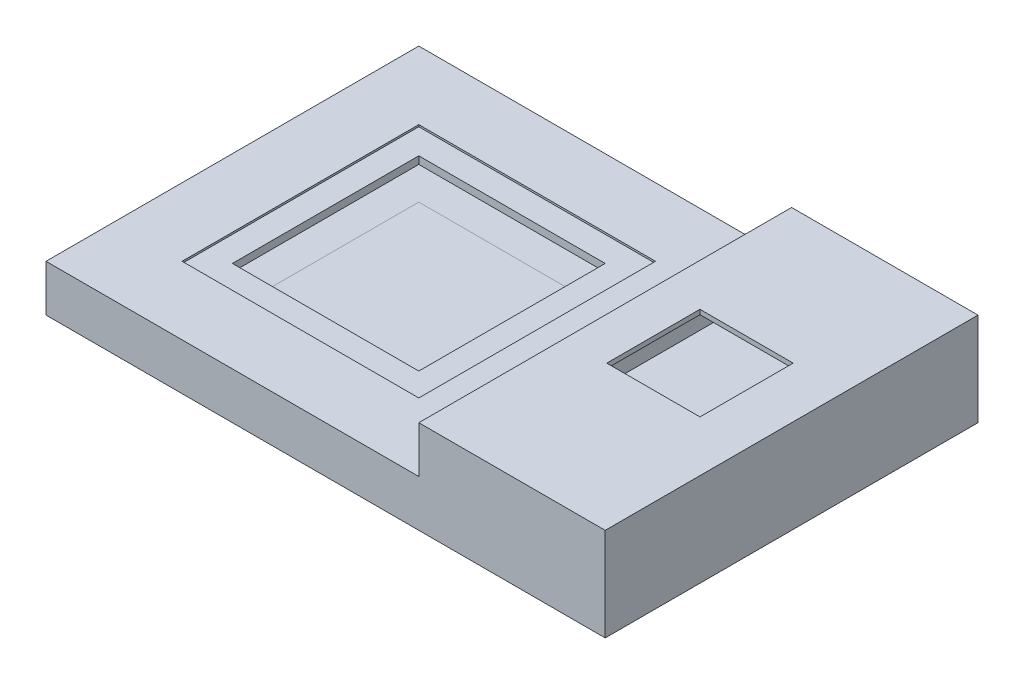
ISO-10303-21;
HEADER;
FILE_DESCRIPTION(('STEP AP214'),'2;1');
FILE_NAME('part.step','',(''),(''),'','','');
FILE_SCHEMA(('AUTOMOTIVE_DESIGN { 1 0 10303 214 1 1 1 1 }'));
ENDSEC;
DATA;
#1=APPLICATION_CONTEXT('core data for automotive mechanical design processes');
#2=APPLICATION_PROTOCOL_DEFINITION('international standard','automotive_design',2000,#1);
#3=PRODUCT_CONTEXT('',#1,'mechanical');
#4=PRODUCT('Part','Part','',(#3));
#5=PRODUCT_RELATED_PRODUCT_CATEGORY('part','',(#4));
#6=PRODUCT_DEFINITION_FORMATION('','',#4);
#7=PRODUCT_DEFINITION_CONTEXT('part definition',#1,'design');
#8=PRODUCT_DEFINITION('design','',#6,#7);
#9=PRODUCT_DEFINITION_SHAPE('','',#8);
#10=(LENGTH_UNIT() NAMED_UNIT(*) SI_UNIT(.MILLI.,.METRE.));
#11=(NAMED_UNIT(*) PLANE_ANGLE_UNIT() SI_UNIT($,.RADIAN.));
#12=(NAMED_UNIT(*) SI_UNIT($,.STERADIAN.) SOLID_ANGLE_UNIT());
#13=UNCERTAINTY_MEASURE_WITH_UNIT(LENGTH_MEASURE(1.E-05),#10,'distance_accuracy_value','');
#14=(GEOMETRIC_REPRESENTATION_CONTEXT(3) GLOBAL_UNCERTAINTY_ASSIGNED_CONTEXT((#13)) GLOBAL_UNIT_ASSIGNED_CONTEXT((#10,
#11,#12)) REPRESENTATION_CONTEXT('',''));
#15=CARTESIAN_POINT('',(0.,0.,0.));
#16=DIRECTION('',(0.,0.,1.));
#17=DIRECTION('',(1.,0.,0.));
#18=AXIS2_PLACEMENT_3D('',#15,#16,#17);
#19=CARTESIAN_POINT('',(10.,-5.,10.));
#20=DIRECTION('',(1.,0.,0.));
#21=DIRECTION('',(0.,1.,0.));
#22=AXIS2_PLACEMENT_3D('',#19,#20,#21);
#23=PLANE('',#22);
#24=DIRECTION('',(0.,0.,-1.));
#25=VECTOR('',#24,1.);
#26=CARTESIAN_POINT('',(10.,-4.5,10.));
#27=LINE('',#26,#25);
#28=CARTESIAN_POINT('',(10.,-4.5,10.));
#29=VERTEX_POINT('',#28);
#30=CARTESIAN_POINT('',(10.,-4.5,-10.));
#31=VERTEX_POINT('',#30);
#32=EDGE_CURVE('E109',#29,#31,#27,.T.);
#33=ORIENTED_EDGE('',*,*,#32,.F.);
#34=DIRECTION('',(0.,1.,0.));
#35=VECTOR('',#34,1.);
#36=CARTESIAN_POINT('',(10.,-5.,10.));
#37=LINE('',#36,#35);
#38=CARTESIAN_POINT('',(10.,-5.,10.));
#39=VERTEX_POINT('',#38);
#40=EDGE_CURVE('E12',#39,#29,#37,.T.);
#41=ORIENTED_EDGE('',*,*,#40,.F.);
#42=DIRECTION('',(0.,0.,-1.));
#43=VECTOR('',#42,1.);
#44=CARTESIAN_POINT('',(10.,-5.,10.));
#45=LINE('',#44,#43);
#46=CARTESIAN_POINT('',(10.,-5.,-10.));
#47=VERTEX_POINT('',#46);
#48=EDGE_CURVE('E103',#39,#47,#45,.T.);
#49=ORIENTED_EDGE('',*,*,#48,.T.);
#50=DIRECTION('',(0.,1.,0.));
#51=VECTOR('',#50,1.);
#52=CARTESIAN_POINT('',(10.,-5.,-10.));
#53=LINE('',#52,#51);
#54=EDGE_CURVE('E48',#47,#31,#53,.T.);
#55=ORIENTED_EDGE('',*,*,#54,.T.);
#56=EDGE_LOOP('',(#33,#41,#49,#55));
#57=FACE_BOUND('',#56,.T.);
#58=ADVANCED_FACE('F45',(#57),#23,.T.);
#59=CARTESIAN_POINT('',(-10.,-5.00000000000001,10.));
#60=DIRECTION('',(0.,0.,1.));
#61=DIRECTION('',(1.,0.,0.));
#62=AXIS2_PLACEMENT_3D('',#59,#60,#61);
#63=PLANE('',#62);
#64=DIRECTION('',(1.,0.,0.));
#65=VECTOR('',#64,1.);
#66=CARTESIAN_POINT('',(-10.,-4.50000000000001,10.));
#67=LINE('',#66,#65);
#68=CARTESIAN_POINT('',(-10.,-4.50000000000001,10.));
#69=VERTEX_POINT('',#68);
#70=EDGE_CURVE('E105',#69,#29,#67,.T.);
#71=ORIENTED_EDGE('',*,*,#70,.F.);
#72=DIRECTION('',(0.,1.,0.));
#73=VECTOR('',#72,1.);
#74=CARTESIAN_POINT('',(-10.,-5.00000000000001,10.));
#75=LINE('',#74,#73);
#76=CARTESIAN_POINT('',(-10.,-5.00000000000001,10.));
#77=VERTEX_POINT('',#76);
#78=EDGE_CURVE('E54',#77,#69,#75,.T.);
#79=ORIENTED_EDGE('',*,*,#78,.F.);
#80=DIRECTION('',(1.,0.,0.));
#81=VECTOR('',#80,1.);
#82=CARTESIAN_POINT('',(-10.,-5.00000000000001,10.));
#83=LINE('',#82,#81);
#84=EDGE_CURVE('E100',#77,#39,#83,.T.);
#85=ORIENTED_EDGE('',*,*,#84,.T.);
#86=ORIENTED_EDGE('',*,*,#40,.T.);
#87=EDGE_LOOP('',(#71,#79,#85,#86));
#88=FACE_BOUND('',#87,.T.);
#89=ADVANCED_FACE('F119',(#88),#63,.T.);
#90=CARTESIAN_POINT('',(-10.,-5.00000000000001,10.));
#91=DIRECTION('',(-1.,0.,0.));
#92=DIRECTION('',(0.,-1.,0.));
#93=AXIS2_PLACEMENT_3D('',#90,#91,#92);
#94=PLANE('',#93);
#95=DIRECTION('',(0.,0.,1.));
#96=VECTOR('',#95,1.);
#97=CARTESIAN_POINT('',(-10.,-4.50000000000001,10.));
#98=LINE('',#97,#96);
#99=CARTESIAN_POINT('',(-10.,-4.50000000000001,-10.));
#100=VERTEX_POINT('',#99);
#101=EDGE_CURVE('E95',#100,#69,#98,.T.);
#102=ORIENTED_EDGE('',*,*,#101,.F.);
#103=DIRECTION('',(0.,1.,0.));
#104=VECTOR('',#103,1.);
#105=CARTESIAN_POINT('',(-10.,-5.00000000000001,-10.));
#106=LINE('',#105,#104);
#107=CARTESIAN_POINT('',(-10.,-5.00000000000001,-10.));
#108=VERTEX_POINT('',#107);
#109=EDGE_CURVE('E90',#108,#100,#106,.T.);
#110=ORIENTED_EDGE('',*,*,#109,.F.);
#111=DIRECTION('',(0.,0.,1.));
#112=VECTOR('',#111,1.);
#113=CARTESIAN_POINT('',(-10.,-5.00000000000001,10.));
#114=LINE('',#113,#112);
#115=EDGE_CURVE('E93',#108,#77,#114,.T.);
#116=ORIENTED_EDGE('',*,*,#115,.T.);
#117=ORIENTED_EDGE('',*,*,#78,.T.);
#118=EDGE_LOOP('',(#102,#110,#116,#117));
#119=FACE_BOUND('',#118,.T.);
#120=ADVANCED_FACE('F92',(#119),#94,.T.);
#121=CARTESIAN_POINT('',(-10.,-5.00000000000001,-10.));
#122=DIRECTION('',(0.,0.,-1.));
#123=DIRECTION('',(-1.,0.,0.));
#124=AXIS2_PLACEMENT_3D('',#121,#122,#123);
#125=PLANE('',#124);
#126=DIRECTION('',(-1.,0.,0.));
#127=VECTOR('',#126,1.);
#128=CARTESIAN_POINT('',(-10.,-4.50000000000001,-10.));
#129=LINE('',#128,#127);
#130=EDGE_CURVE('E112',#31,#100,#129,.T.);
#131=ORIENTED_EDGE('',*,*,#130,.F.);
#132=ORIENTED_EDGE('',*,*,#54,.F.);
#133=DIRECTION('',(-1.,0.,0.));
#134=VECTOR('',#133,1.);
#135=CARTESIAN_POINT('',(-10.,-5.00000000000001,-10.));
#136=LINE('',#135,#134);
#137=EDGE_CURVE('E99',#47,#108,#136,.T.);
#138=ORIENTED_EDGE('',*,*,#137,.T.);
#139=ORIENTED_EDGE('',*,*,#109,.T.);
#140=EDGE_LOOP('',(#131,#132,#138,#139));
#141=FACE_BOUND('',#140,.T.);
#142=ADVANCED_FACE('F102',(#141),#125,.T.);
#143=CARTESIAN_POINT('',(0.,-5.,0.));
#144=DIRECTION('',(0.,-1.,0.));
#145=DIRECTION('',(1.,0.,0.));
#146=AXIS2_PLACEMENT_3D('',#143,#144,#145);
#147=PLANE('',#146);
#148=ORIENTED_EDGE('',*,*,#48,.F.);
#149=ORIENTED_EDGE('',*,*,#84,.F.);
#150=ORIENTED_EDGE('',*,*,#115,.F.);
#151=ORIENTED_EDGE('',*,*,#137,.F.);
#152=EDGE_LOOP('',(#148,#149,#150,#151));
#153=FACE_BOUND('',#152,.T.);
#154=ADVANCED_FACE('F98',(#153),#147,.T.);
#155=CARTESIAN_POINT('',(0.,-4.5,0.));
#156=DIRECTION('',(0.,-1.,0.));
#157=DIRECTION('',(1.,0.,0.));
#158=AXIS2_PLACEMENT_3D('',#155,#156,#157);
#159=PLANE('',#158);
#160=ORIENTED_EDGE('',*,*,#32,.T.);
#161=ORIENTED_EDGE('',*,*,#130,.T.);
#162=ORIENTED_EDGE('',*,*,#101,.T.);
#163=ORIENTED_EDGE('',*,*,#70,.T.);
#164=EDGE_LOOP('',(#160,#161,#162,#163));
#165=FACE_BOUND('',#164,.T.);
#166=ADVANCED_FACE('F118',(#165),#159,.F.);
#167=CLOSED_SHELL('',(#58,#89,#120,#142,#154,#166));
#168=MANIFOLD_SOLID_BREP('B2',#167);
#169=CARTESIAN_POINT('',(39.5,-1.,19.5));
#170=DIRECTION('',(0.,-1.,0.));
#171=DIRECTION('',(1.,0.,0.));
#172=AXIS2_PLACEMENT_3D('',#169,#170,#171);
#173=PLANE('',#172);
#174=DIRECTION('',(0.,0.,-1.));
#175=VECTOR('',#174,1.);
#176=CARTESIAN_POINT('',(10.,-1.,0.));
#177=LINE('',#176,#175);
#178=CARTESIAN_POINT('',(10.,-1.,9.99999999999999));
#179=VERTEX_POINT('',#178);
#180=CARTESIAN_POINT('',(10.,-1.,-10.));
#181=VERTEX_POINT('',#180);
#182=EDGE_CURVE('E437',#179,#181,#177,.T.);
#183=ORIENTED_EDGE('',*,*,#182,.T.);
#184=DIRECTION('',(1.,0.,0.));
#185=VECTOR('',#184,1.);
#186=CARTESIAN_POINT('',(0.,-1.00000000000001,-10.));
#187=LINE('',#186,#185);
#188=CARTESIAN_POINT('',(-9.99999999999999,-1.00000000000001,-10.));
#189=VERTEX_POINT('',#188);
#190=EDGE_CURVE('E434',#189,#181,#187,.T.);
#191=ORIENTED_EDGE('',*,*,#190,.F.);
#192=DIRECTION('',(0.,0.,-1.));
#193=VECTOR('',#192,1.);
#194=CARTESIAN_POINT('',(-9.99999999999999,-1.00000000000001,0.));
#195=LINE('',#194,#193);
#196=CARTESIAN_POINT('',(-9.99999999999999,-1.00000000000001,9.99999999999999));
#197=VERTEX_POINT('',#196);
#198=EDGE_CURVE('E431',#197,#189,#195,.T.);
#199=ORIENTED_EDGE('',*,*,#198,.F.);
#200=DIRECTION('',(1.,0.,0.));
#201=VECTOR('',#200,1.);
#202=CARTESIAN_POINT('',(0.,-1.00000000000001,9.99999999999999));
#203=LINE('',#202,#201);
#204=EDGE_CURVE('E560',#197,#179,#203,.T.);
#205=ORIENTED_EDGE('',*,*,#204,.T.);
#206=EDGE_LOOP('',(#183,#191,#199,#205));
#207=FACE_BOUND('',#206,.T.);
#208=DIRECTION('',(0.,0.,-1.));
#209=VECTOR('',#208,1.);
#210=CARTESIAN_POINT('',(-19.5,-1.00000000000001,19.5));
#211=LINE('',#210,#209);
#212=CARTESIAN_POINT('',(-19.5,-1.00000000000001,19.5));
#213=VERTEX_POINT('',#212);
#214=CARTESIAN_POINT('',(-19.5,-1.00000000000001,-19.5));
#215=VERTEX_POINT('',#214);
#216=EDGE_CURVE('E420',#213,#215,#211,.T.);
#217=ORIENTED_EDGE('',*,*,#216,.T.);
#218=DIRECTION('',(-1.,0.,0.));
#219=VECTOR('',#218,1.);
#220=CARTESIAN_POINT('',(39.5,-1.,-19.5));
#221=LINE('',#220,#219);
#222=CARTESIAN_POINT('',(20.5,-1.,-19.5));
#223=VERTEX_POINT('',#222);
#224=EDGE_CURVE('E400',#223,#215,#221,.T.);
#225=ORIENTED_EDGE('',*,*,#224,.F.);
#226=DIRECTION('',(0.,0.,-1.));
#227=VECTOR('',#226,1.);
#228=CARTESIAN_POINT('',(20.5,-1.,19.5));
#229=LINE('',#228,#227);
#230=CARTESIAN_POINT('',(20.5,-1.,19.5));
#231=VERTEX_POINT('',#230);
#232=EDGE_CURVE('E395',#231,#223,#229,.T.);
#233=ORIENTED_EDGE('',*,*,#232,.F.);
#234=DIRECTION('',(-1.,0.,0.));
#235=VECTOR('',#234,1.);
#236=CARTESIAN_POINT('',(39.5,-1.,19.5));
#237=LINE('',#236,#235);
#238=EDGE_CURVE('E409',#231,#213,#237,.T.);
#239=ORIENTED_EDGE('',*,*,#238,.T.);
#240=EDGE_LOOP('',(#217,#225,#233,#239));
#241=FACE_BOUND('',#240,.T.);
#242=ADVANCED_FACE('F169',(#207,#241),#173,.T.);
#243=CARTESIAN_POINT('',(10.,-5.,0.));
#244=DIRECTION('',(1.,0.,0.));
#245=DIRECTION('',(0.,0.,-1.));
#246=AXIS2_PLACEMENT_3D('',#243,#244,#245);
#247=PLANE('',#246);
#248=ORIENTED_EDGE('',*,*,#182,.F.);
#249=DIRECTION('',(0.,1.,0.));
#250=VECTOR('',#249,1.);
#251=CARTESIAN_POINT('',(10.,-5.,9.99999999999999));
#252=LINE('',#251,#250);
#253=CARTESIAN_POINT('',(10.,-0.2,9.99999999999999));
#254=VERTEX_POINT('',#253);
#255=EDGE_CURVE('E524',#179,#254,#252,.T.);
#256=ORIENTED_EDGE('',*,*,#255,.T.);
#257=DIRECTION('',(0.,0.,1.));
#258=VECTOR('',#257,1.);
#259=CARTESIAN_POINT('',(10.,-0.2,0.));
#260=LINE('',#259,#258);
#261=CARTESIAN_POINT('',(10.,-0.2,-10.));
#262=VERTEX_POINT('',#261);
#263=EDGE_CURVE('E477',#262,#254,#260,.T.);
#264=ORIENTED_EDGE('',*,*,#263,.F.);
#265=DIRECTION('',(0.,1.,0.));
#266=VECTOR('',#265,1.);
#267=CARTESIAN_POINT('',(10.,-5.,-10.));
#268=LINE('',#267,#266);
#269=EDGE_CURVE('E544',#181,#262,#268,.T.);
#270=ORIENTED_EDGE('',*,*,#269,.F.);
#271=EDGE_LOOP('',(#248,#256,#264,#270));
#272=FACE_BOUND('',#271,.T.);
#273=ADVANCED_FACE('F171',(#272),#247,.F.);
#274=DIRECTION('',(0.,0.,1.));
#275=VECTOR('',#274,1.);
#276=CARTESIAN_POINT('',(10.,-4.5,0.));
#277=LINE('',#276,#275);
#278=CARTESIAN_POINT('',(10.,-4.5,-10.));
#279=VERTEX_POINT('',#278);
#280=CARTESIAN_POINT('',(10.,-4.5,9.99999999999999));
#281=VERTEX_POINT('',#280);
#282=EDGE_CURVE('E429',#279,#281,#277,.T.);
#283=ORIENTED_EDGE('',*,*,#282,.F.);
#284=CARTESIAN_POINT('',(10.,-5.,-10.));
#285=VERTEX_POINT('',#284);
#286=EDGE_CURVE('E541',#285,#279,#268,.T.);
#287=ORIENTED_EDGE('',*,*,#286,.F.);
#288=DIRECTION('',(0.,0.,-1.));
#289=VECTOR('',#288,1.);
#290=CARTESIAN_POINT('',(10.,-5.,0.));
#291=LINE('',#290,#289);
#292=CARTESIAN_POINT('',(10.,-5.,9.99999999999999));
#293=VERTEX_POINT('',#292);
#294=EDGE_CURVE('E506',#293,#285,#291,.T.);
#295=ORIENTED_EDGE('',*,*,#294,.F.);
#296=EDGE_CURVE('E553',#293,#281,#252,.T.);
#297=ORIENTED_EDGE('',*,*,#296,.T.);
#298=EDGE_LOOP('',(#283,#287,#295,#297));
#299=FACE_BOUND('',#298,.T.);
#300=ADVANCED_FACE('F589',(#299),#247,.F.);
#301=CARTESIAN_POINT('',(0.,-5.,-10.));
#302=DIRECTION('',(0.,0.,1.));
#303=DIRECTION('',(1.,0.,0.));
#304=AXIS2_PLACEMENT_3D('',#301,#302,#303);
#305=PLANE('',#304);
#306=DIRECTION('',(0.,1.,0.));
#307=VECTOR('',#306,1.);
#308=CARTESIAN_POINT('',(-9.99999999999999,-5.,-10.));
#309=LINE('',#308,#307);
#310=CARTESIAN_POINT('',(-9.99999999999999,-0.2,-10.));
#311=VERTEX_POINT('',#310);
#312=EDGE_CURVE('E548',#189,#311,#309,.T.);
#313=ORIENTED_EDGE('',*,*,#312,.F.);
#314=ORIENTED_EDGE('',*,*,#190,.T.);
#315=ORIENTED_EDGE('',*,*,#269,.T.);
#316=DIRECTION('',(-1.,0.,0.));
#317=VECTOR('',#316,1.);
#318=CARTESIAN_POINT('',(0.,-0.2,-10.));
#319=LINE('',#318,#317);
#320=EDGE_CURVE('E474',#262,#311,#319,.T.);
#321=ORIENTED_EDGE('',*,*,#320,.T.);
#322=EDGE_LOOP('',(#313,#314,#315,#321));
#323=FACE_BOUND('',#322,.T.);
#324=ADVANCED_FACE('F652',(#323),#305,.T.);
#325=ORIENTED_EDGE('',*,*,#286,.T.);
#326=DIRECTION('',(-1.,0.,0.));
#327=VECTOR('',#326,1.);
#328=CARTESIAN_POINT('',(0.,-4.5,-10.));
#329=LINE('',#328,#327);
#330=CARTESIAN_POINT('',(-9.99999999999999,-4.50000000000001,-10.));
#331=VERTEX_POINT('',#330);
#332=EDGE_CURVE('E426',#279,#331,#329,.T.);
#333=ORIENTED_EDGE('',*,*,#332,.T.);
#334=CARTESIAN_POINT('',(-9.99999999999999,-5.,-10.));
#335=VERTEX_POINT('',#334);
#336=EDGE_CURVE('E545',#335,#331,#309,.T.);
#337=ORIENTED_EDGE('',*,*,#336,.F.);
#338=DIRECTION('',(1.,0.,0.));
#339=VECTOR('',#338,1.);
#340=CARTESIAN_POINT('',(0.,-5.,-10.));
#341=LINE('',#340,#339);
#342=EDGE_CURVE('E514',#335,#285,#341,.T.);
#343=ORIENTED_EDGE('',*,*,#342,.T.);
#344=EDGE_LOOP('',(#325,#333,#337,#343));
#345=FACE_BOUND('',#344,.T.);
#346=ADVANCED_FACE('F655',(#345),#305,.T.);
#347=CARTESIAN_POINT('',(-9.99999999999999,-5.,0.));
#348=DIRECTION('',(1.,0.,0.));
#349=DIRECTION('',(0.,0.,-1.));
#350=AXIS2_PLACEMENT_3D('',#347,#348,#349);
#351=PLANE('',#350);
#352=DIRECTION('',(0.,1.,0.));
#353=VECTOR('',#352,1.);
#354=CARTESIAN_POINT('',(-9.99999999999999,-5.,9.99999999999999));
#355=LINE('',#354,#353);
#356=CARTESIAN_POINT('',(-9.99999999999999,-0.2,9.99999999999999));
#357=VERTEX_POINT('',#356);
#358=EDGE_CURVE('E552',#197,#357,#355,.T.);
#359=ORIENTED_EDGE('',*,*,#358,.F.);
#360=ORIENTED_EDGE('',*,*,#198,.T.);
#361=ORIENTED_EDGE('',*,*,#312,.T.);
#362=DIRECTION('',(0.,0.,1.));
#363=VECTOR('',#362,1.);
#364=CARTESIAN_POINT('',(-9.99999999999999,-0.2,0.));
#365=LINE('',#364,#363);
#366=EDGE_CURVE('E465',#311,#357,#365,.T.);
#367=ORIENTED_EDGE('',*,*,#366,.T.);
#368=EDGE_LOOP('',(#359,#360,#361,#367));
#369=FACE_BOUND('',#368,.T.);
#370=ADVANCED_FACE('F657',(#369),#351,.T.);
#371=ORIENTED_EDGE('',*,*,#336,.T.);
#372=DIRECTION('',(0.,0.,1.));
#373=VECTOR('',#372,1.);
#374=CARTESIAN_POINT('',(-9.99999999999999,-4.50000000000001,0.));
#375=LINE('',#374,#373);
#376=CARTESIAN_POINT('',(-9.99999999999999,-4.50000000000001,9.99999999999999));
#377=VERTEX_POINT('',#376);
#378=EDGE_CURVE('E423',#331,#377,#375,.T.);
#379=ORIENTED_EDGE('',*,*,#378,.T.);
#380=CARTESIAN_POINT('',(-9.99999999999999,-5.,9.99999999999999));
#381=VERTEX_POINT('',#380);
#382=EDGE_CURVE('E549',#381,#377,#355,.T.);
#383=ORIENTED_EDGE('',*,*,#382,.F.);
#384=DIRECTION('',(0.,0.,-1.));
#385=VECTOR('',#384,1.);
#386=CARTESIAN_POINT('',(-9.99999999999999,-5.,0.));
#387=LINE('',#386,#385);
#388=EDGE_CURVE('E511',#381,#335,#387,.T.);
#389=ORIENTED_EDGE('',*,*,#388,.T.);
#390=EDGE_LOOP('',(#371,#379,#383,#389));
#391=FACE_BOUND('',#390,.T.);
#392=ADVANCED_FACE('F659',(#391),#351,.T.);
#393=CARTESIAN_POINT('',(0.,-5.,9.99999999999999));
#394=DIRECTION('',(0.,0.,1.));
#395=DIRECTION('',(1.,0.,0.));
#396=AXIS2_PLACEMENT_3D('',#393,#394,#395);
#397=PLANE('',#396);
#398=ORIENTED_EDGE('',*,*,#204,.F.);
#399=ORIENTED_EDGE('',*,*,#358,.T.);
#400=DIRECTION('',(-1.,0.,0.));
#401=VECTOR('',#400,1.);
#402=CARTESIAN_POINT('',(0.,-0.2,9.99999999999999));
#403=LINE('',#402,#401);
#404=EDGE_CURVE('E537',#254,#357,#403,.T.);
#405=ORIENTED_EDGE('',*,*,#404,.F.);
#406=ORIENTED_EDGE('',*,*,#255,.F.);
#407=EDGE_LOOP('',(#398,#399,#405,#406));
#408=FACE_BOUND('',#407,.T.);
#409=ADVANCED_FACE('F661',(#408),#397,.F.);
#410=DIRECTION('',(-1.,0.,0.));
#411=VECTOR('',#410,1.);
#412=CARTESIAN_POINT('',(0.,-4.5,9.99999999999999));
#413=LINE('',#412,#411);
#414=EDGE_CURVE('E558',#281,#377,#413,.T.);
#415=ORIENTED_EDGE('',*,*,#414,.F.);
#416=ORIENTED_EDGE('',*,*,#296,.F.);
#417=DIRECTION('',(1.,0.,0.));
#418=VECTOR('',#417,1.);
#419=CARTESIAN_POINT('',(0.,-5.,9.99999999999999));
#420=LINE('',#419,#418);
#421=EDGE_CURVE('E508',#381,#293,#420,.T.);
#422=ORIENTED_EDGE('',*,*,#421,.F.);
#423=ORIENTED_EDGE('',*,*,#382,.T.);
#424=EDGE_LOOP('',(#415,#416,#422,#423));
#425=FACE_BOUND('',#424,.T.);
#426=ADVANCED_FACE('F650',(#425),#397,.F.);
#427=CARTESIAN_POINT('',(0.,-5.,20.));
#428=DIRECTION('',(0.,0.,1.));
#429=DIRECTION('',(1.,0.,0.));
#430=AXIS2_PLACEMENT_3D('',#427,#428,#429);
#431=PLANE('',#430);
#432=DIRECTION('',(1.,0.,0.));
#433=VECTOR('',#432,1.);
#434=CARTESIAN_POINT('',(0.,0.,20.));
#435=LINE('',#434,#433);
#436=CARTESIAN_POINT('',(-20.,0.,20.));
#437=VERTEX_POINT('',#436);
#438=CARTESIAN_POINT('',(20.,0.,20.));
#439=VERTEX_POINT('',#438);
#440=EDGE_CURVE('E498',#437,#439,#435,.T.);
#441=ORIENTED_EDGE('',*,*,#440,.F.);
#442=DIRECTION('',(0.,1.,0.));
#443=VECTOR('',#442,1.);
#444=CARTESIAN_POINT('',(-20.,-5.,20.));
#445=LINE('',#444,#443);
#446=CARTESIAN_POINT('',(-20.,-5.,20.));
#447=VERTEX_POINT('',#446);
#448=EDGE_CURVE('E535',#447,#437,#445,.T.);
#449=ORIENTED_EDGE('',*,*,#448,.F.);
#450=DIRECTION('',(1.,0.,0.));
#451=VECTOR('',#450,1.);
#452=CARTESIAN_POINT('',(0.,-5.,20.));
#453=LINE('',#452,#451);
#454=CARTESIAN_POINT('',(40.,-5.,20.));
#455=VERTEX_POINT('',#454);
#456=EDGE_CURVE('E517',#447,#455,#453,.T.);
#457=ORIENTED_EDGE('',*,*,#456,.T.);
#458=DIRECTION('',(0.,-1.,0.));
#459=VECTOR('',#458,1.);
#460=CARTESIAN_POINT('',(40.,5.,20.));
#461=LINE('',#460,#459);
#462=CARTESIAN_POINT('',(40.,5.,20.));
#463=VERTEX_POINT('',#462);
#464=EDGE_CURVE('E499',#463,#455,#461,.T.);
#465=ORIENTED_EDGE('',*,*,#464,.F.);
#466=DIRECTION('',(1.,0.,0.));
#467=VECTOR('',#466,1.);
#468=CARTESIAN_POINT('',(20.,5.,20.));
#469=LINE('',#468,#467);
#470=CARTESIAN_POINT('',(20.,5.,20.));
#471=VERTEX_POINT('',#470);
#472=EDGE_CURVE('E492',#471,#463,#469,.T.);
#473=ORIENTED_EDGE('',*,*,#472,.F.);
#474=DIRECTION('',(0.,-1.,0.));
#475=VECTOR('',#474,1.);
#476=CARTESIAN_POINT('',(20.,5.,20.));
#477=LINE('',#476,#475);
#478=EDGE_CURVE('E495',#471,#439,#477,.T.);
#479=ORIENTED_EDGE('',*,*,#478,.T.);
#480=EDGE_LOOP('',(#441,#449,#457,#465,#473,#479));
#481=FACE_BOUND('',#480,.T.);
#482=ADVANCED_FACE('F643',(#481),#431,.T.);
#483=CARTESIAN_POINT('',(-20.,-5.,0.));
#484=DIRECTION('',(1.,0.,0.));
#485=DIRECTION('',(0.,0.,-1.));
#486=AXIS2_PLACEMENT_3D('',#483,#484,#485);
#487=PLANE('',#486);
#488=DIRECTION('',(0.,0.,-1.));
#489=VECTOR('',#488,1.);
#490=CARTESIAN_POINT('',(-20.,0.,0.));
#491=LINE('',#490,#489);
#492=CARTESIAN_POINT('',(-20.,0.,-20.));
#493=VERTEX_POINT('',#492);
#494=EDGE_CURVE('E509',#437,#493,#491,.T.);
#495=ORIENTED_EDGE('',*,*,#494,.T.);
#496=DIRECTION('',(0.,1.,0.));
#497=VECTOR('',#496,1.);
#498=CARTESIAN_POINT('',(-20.,-5.,-20.));
#499=LINE('',#498,#497);
#500=CARTESIAN_POINT('',(-20.,-5.,-20.));
#501=VERTEX_POINT('',#500);
#502=EDGE_CURVE('E538',#501,#493,#499,.T.);
#503=ORIENTED_EDGE('',*,*,#502,.F.);
#504=DIRECTION('',(0.,0.,-1.));
#505=VECTOR('',#504,1.);
#506=CARTESIAN_POINT('',(-20.,-5.,0.));
#507=LINE('',#506,#505);
#508=EDGE_CURVE('E521',#447,#501,#507,.T.);
#509=ORIENTED_EDGE('',*,*,#508,.F.);
#510=ORIENTED_EDGE('',*,*,#448,.T.);
#511=EDGE_LOOP('',(#495,#503,#509,#510));
#512=FACE_BOUND('',#511,.T.);
#513=ADVANCED_FACE('F640',(#512),#487,.F.);
#514=CARTESIAN_POINT('',(0.,-5.,-20.));
#515=DIRECTION('',(0.,0.,1.));
#516=DIRECTION('',(1.,0.,0.));
#517=AXIS2_PLACEMENT_3D('',#514,#515,#516);
#518=PLANE('',#517);
#519=DIRECTION('',(1.,0.,0.));
#520=VECTOR('',#519,1.);
#521=CARTESIAN_POINT('',(0.,0.,-20.));
#522=LINE('',#521,#520);
#523=CARTESIAN_POINT('',(20.,0.,-20.));
#524=VERTEX_POINT('',#523);
#525=EDGE_CURVE('E530',#493,#524,#522,.T.);
#526=ORIENTED_EDGE('',*,*,#525,.T.);
#527=DIRECTION('',(0.,-1.,0.));
#528=VECTOR('',#527,1.);
#529=CARTESIAN_POINT('',(20.,5.,-20.));
#530=LINE('',#529,#528);
#531=CARTESIAN_POINT('',(20.,5.,-20.));
#532=VERTEX_POINT('',#531);
#533=EDGE_CURVE('E494',#532,#524,#530,.T.);
#534=ORIENTED_EDGE('',*,*,#533,.F.);
#535=DIRECTION('',(1.,0.,0.));
#536=VECTOR('',#535,1.);
#537=CARTESIAN_POINT('',(20.,5.,-20.));
#538=LINE('',#537,#536);
#539=CARTESIAN_POINT('',(40.,5.,-20.));
#540=VERTEX_POINT('',#539);
#541=EDGE_CURVE('E486',#532,#540,#538,.T.);
#542=ORIENTED_EDGE('',*,*,#541,.T.);
#543=DIRECTION('',(0.,-1.,0.));
#544=VECTOR('',#543,1.);
#545=CARTESIAN_POINT('',(40.,5.,-20.));
#546=LINE('',#545,#544);
#547=CARTESIAN_POINT('',(40.,-5.,-20.));
#548=VERTEX_POINT('',#547);
#549=EDGE_CURVE('E502',#540,#548,#546,.T.);
#550=ORIENTED_EDGE('',*,*,#549,.T.);
#551=DIRECTION('',(1.,0.,0.));
#552=VECTOR('',#551,1.);
#553=CARTESIAN_POINT('',(0.,-5.,-20.));
#554=LINE('',#553,#552);
#555=EDGE_CURVE('E519',#501,#548,#554,.T.);
#556=ORIENTED_EDGE('',*,*,#555,.F.);
#557=ORIENTED_EDGE('',*,*,#502,.T.);
#558=EDGE_LOOP('',(#526,#534,#542,#550,#556,#557));
#559=FACE_BOUND('',#558,.T.);
#560=ADVANCED_FACE('F635',(#559),#518,.F.);
#561=CARTESIAN_POINT('',(0.,-5.,0.));
#562=DIRECTION('',(0.,1.,0.));
#563=DIRECTION('',(0.,0.,1.));
#564=AXIS2_PLACEMENT_3D('',#561,#562,#563);
#565=PLANE('',#564);
#566=ORIENTED_EDGE('',*,*,#294,.T.);
#567=ORIENTED_EDGE('',*,*,#342,.F.);
#568=ORIENTED_EDGE('',*,*,#388,.F.);
#569=ORIENTED_EDGE('',*,*,#421,.T.);
#570=EDGE_LOOP('',(#566,#567,#568,#569));
#571=FACE_BOUND('',#570,.T.);
#572=ORIENTED_EDGE('',*,*,#456,.F.);
#573=ORIENTED_EDGE('',*,*,#508,.T.);
#574=ORIENTED_EDGE('',*,*,#555,.T.);
#575=DIRECTION('',(0.,0.,1.));
#576=VECTOR('',#575,1.);
#577=CARTESIAN_POINT('',(40.,-5.,-20.));
#578=LINE('',#577,#576);
#579=EDGE_CURVE('E480',#548,#455,#578,.T.);
#580=ORIENTED_EDGE('',*,*,#579,.T.);
#581=EDGE_LOOP('',(#572,#573,#574,#580));
#582=FACE_BOUND('',#581,.T.);
#583=ADVANCED_FACE('F632',(#571,#582),#565,.F.);
#584=CARTESIAN_POINT('',(0.,0.,0.));
#585=DIRECTION('',(0.,1.,0.));
#586=DIRECTION('',(0.,0.,1.));
#587=AXIS2_PLACEMENT_3D('',#584,#585,#586);
#588=PLANE('',#587);
#589=DIRECTION('',(0.,0.,1.));
#590=VECTOR('',#589,1.);
#591=CARTESIAN_POINT('',(-12.7,0.,-12.7));
#592=LINE('',#591,#590);
#593=CARTESIAN_POINT('',(-12.7,0.,-12.7));
#594=VERTEX_POINT('',#593);
#595=CARTESIAN_POINT('',(-12.7,0.,12.7));
#596=VERTEX_POINT('',#595);
#597=EDGE_CURVE('E439',#594,#596,#592,.T.);
#598=ORIENTED_EDGE('',*,*,#597,.F.);
#599=DIRECTION('',(-1.,0.,0.));
#600=VECTOR('',#599,1.);
#601=CARTESIAN_POINT('',(-12.7,0.,-12.7));
#602=LINE('',#601,#600);
#603=CARTESIAN_POINT('',(12.7,0.,-12.7));
#604=VERTEX_POINT('',#603);
#605=EDGE_CURVE('E444',#604,#594,#602,.T.);
#606=ORIENTED_EDGE('',*,*,#605,.F.);
#607=DIRECTION('',(0.,0.,-1.));
#608=VECTOR('',#607,1.);
#609=CARTESIAN_POINT('',(12.7,0.,-12.7));
#610=LINE('',#609,#608);
#611=CARTESIAN_POINT('',(12.7,0.,12.7));
#612=VERTEX_POINT('',#611);
#613=EDGE_CURVE('E458',#612,#604,#610,.T.);
#614=ORIENTED_EDGE('',*,*,#613,.F.);
#615=DIRECTION('',(1.,0.,0.));
#616=VECTOR('',#615,1.);
#617=CARTESIAN_POINT('',(-12.7,0.,12.7));
#618=LINE('',#617,#616);
#619=EDGE_CURVE('E455',#596,#612,#618,.T.);
#620=ORIENTED_EDGE('',*,*,#619,.F.);
#621=EDGE_LOOP('',(#598,#606,#614,#620));
#622=FACE_BOUND('',#621,.T.);
#623=ORIENTED_EDGE('',*,*,#440,.T.);
#624=DIRECTION('',(0.,0.,-1.));
#625=VECTOR('',#624,1.);
#626=CARTESIAN_POINT('',(20.,0.,0.));
#627=LINE('',#626,#625);
#628=EDGE_CURVE('E527',#439,#524,#627,.T.);
#629=ORIENTED_EDGE('',*,*,#628,.T.);
#630=ORIENTED_EDGE('',*,*,#525,.F.);
#631=ORIENTED_EDGE('',*,*,#494,.F.);
#632=EDGE_LOOP('',(#623,#629,#630,#631));
#633=FACE_BOUND('',#632,.T.);
#634=ADVANCED_FACE('F630',(#622,#633),#588,.T.);
#635=CARTESIAN_POINT('',(20.,5.,20.));
#636=DIRECTION('',(-1.,0.,0.));
#637=DIRECTION('',(0.,0.,1.));
#638=AXIS2_PLACEMENT_3D('',#635,#636,#637);
#639=PLANE('',#638);
#640=ORIENTED_EDGE('',*,*,#628,.F.);
#641=ORIENTED_EDGE('',*,*,#478,.F.);
#642=DIRECTION('',(0.,0.,-1.));
#643=VECTOR('',#642,1.);
#644=CARTESIAN_POINT('',(20.,5.,20.));
#645=LINE('',#644,#643);
#646=EDGE_CURVE('E483',#471,#532,#645,.T.);
#647=ORIENTED_EDGE('',*,*,#646,.T.);
#648=ORIENTED_EDGE('',*,*,#533,.T.);
#649=EDGE_LOOP('',(#640,#641,#647,#648));
#650=FACE_BOUND('',#649,.T.);
#651=ADVANCED_FACE('F626',(#650),#639,.T.);
#652=CARTESIAN_POINT('',(40.,5.,-20.));
#653=DIRECTION('',(1.,0.,0.));
#654=DIRECTION('',(0.,0.,-1.));
#655=AXIS2_PLACEMENT_3D('',#652,#653,#654);
#656=PLANE('',#655);
#657=ORIENTED_EDGE('',*,*,#464,.T.);
#658=ORIENTED_EDGE('',*,*,#579,.F.);
#659=ORIENTED_EDGE('',*,*,#549,.F.);
#660=DIRECTION('',(0.,0.,1.));
#661=VECTOR('',#660,1.);
#662=CARTESIAN_POINT('',(40.,5.,-20.));
#663=LINE('',#662,#661);
#664=EDGE_CURVE('E489',#540,#463,#663,.T.);
#665=ORIENTED_EDGE('',*,*,#664,.T.);
#666=EDGE_LOOP('',(#657,#658,#659,#665));
#667=FACE_BOUND('',#666,.T.);
#668=ADVANCED_FACE('F623',(#667),#656,.T.);
#669=CARTESIAN_POINT('',(0.,5.,0.));
#670=DIRECTION('',(0.,-1.,0.));
#671=DIRECTION('',(0.,0.,-1.));
#672=AXIS2_PLACEMENT_3D('',#669,#670,#671);
#673=PLANE('',#672);
#674=DIRECTION('',(-1.,0.,0.));
#675=VECTOR('',#674,1.);
#676=CARTESIAN_POINT('',(24.5459315856701,5.,-5.62290853294521));
#677=LINE('',#676,#675);
#678=CARTESIAN_POINT('',(34.5459315856701,5.,-5.62290853294521));
#679=VERTEX_POINT('',#678);
#680=CARTESIAN_POINT('',(24.5459315856701,5.,-5.62290853294521));
#681=VERTEX_POINT('',#680);
#682=EDGE_CURVE('E365',#679,#681,#677,.T.);
#683=ORIENTED_EDGE('',*,*,#682,.F.);
#684=DIRECTION('',(0.,0.,-1.));
#685=VECTOR('',#684,1.);
#686=CARTESIAN_POINT('',(34.5459315856701,5.,-5.62290853294521));
#687=LINE('',#686,#685);
#688=CARTESIAN_POINT('',(34.5459315856701,5.,4.37709146705479));
#689=VERTEX_POINT('',#688);
#690=EDGE_CURVE('E184',#689,#679,#687,.T.);
#691=ORIENTED_EDGE('',*,*,#690,.F.);
#692=DIRECTION('',(1.,0.,0.));
#693=VECTOR('',#692,1.);
#694=CARTESIAN_POINT('',(24.5459315856701,5.,4.37709146705479));
#695=LINE('',#694,#693);
#696=CARTESIAN_POINT('',(24.5459315856701,5.,4.37709146705479));
#697=VERTEX_POINT('',#696);
#698=EDGE_CURVE('E372',#697,#689,#695,.T.);
#699=ORIENTED_EDGE('',*,*,#698,.F.);
#700=DIRECTION('',(0.,0.,1.));
#701=VECTOR('',#700,1.);
#702=CARTESIAN_POINT('',(24.5459315856701,5.,-5.62290853294521));
#703=LINE('',#702,#701);
#704=EDGE_CURVE('E356',#681,#697,#703,.T.);
#705=ORIENTED_EDGE('',*,*,#704,.F.);
#706=EDGE_LOOP('',(#683,#691,#699,#705));
#707=FACE_BOUND('',#706,.T.);
#708=ORIENTED_EDGE('',*,*,#646,.F.);
#709=ORIENTED_EDGE('',*,*,#472,.T.);
#710=ORIENTED_EDGE('',*,*,#664,.F.);
#711=ORIENTED_EDGE('',*,*,#541,.F.);
#712=EDGE_LOOP('',(#708,#709,#710,#711));
#713=FACE_BOUND('',#712,.T.);
#714=ADVANCED_FACE('F369',(#707,#713),#673,.F.);
#715=CARTESIAN_POINT('',(0.,-0.2,0.));
#716=DIRECTION('',(0.,1.,0.));
#717=DIRECTION('',(0.,0.,1.));
#718=AXIS2_PLACEMENT_3D('',#715,#716,#717);
#719=PLANE('',#718);
#720=DIRECTION('',(0.,0.,1.));
#721=VECTOR('',#720,1.);
#722=CARTESIAN_POINT('',(-12.7,-0.2,-12.7));
#723=LINE('',#722,#721);
#724=CARTESIAN_POINT('',(-12.7,-0.2,-12.7));
#725=VERTEX_POINT('',#724);
#726=CARTESIAN_POINT('',(-12.7,-0.2,12.7));
#727=VERTEX_POINT('',#726);
#728=EDGE_CURVE('E440',#725,#727,#723,.T.);
#729=ORIENTED_EDGE('',*,*,#728,.T.);
#730=DIRECTION('',(1.,0.,0.));
#731=VECTOR('',#730,1.);
#732=CARTESIAN_POINT('',(-12.7,-0.2,12.7));
#733=LINE('',#732,#731);
#734=CARTESIAN_POINT('',(12.7,-0.2,12.7));
#735=VERTEX_POINT('',#734);
#736=EDGE_CURVE('E443',#727,#735,#733,.T.);
#737=ORIENTED_EDGE('',*,*,#736,.T.);
#738=DIRECTION('',(0.,0.,-1.));
#739=VECTOR('',#738,1.);
#740=CARTESIAN_POINT('',(12.7,-0.2,-12.7));
#741=LINE('',#740,#739);
#742=CARTESIAN_POINT('',(12.7,-0.2,-12.7));
#743=VERTEX_POINT('',#742);
#744=EDGE_CURVE('E447',#735,#743,#741,.T.);
#745=ORIENTED_EDGE('',*,*,#744,.T.);
#746=DIRECTION('',(-1.,0.,0.));
#747=VECTOR('',#746,1.);
#748=CARTESIAN_POINT('',(-12.7,-0.2,-12.7));
#749=LINE('',#748,#747);
#750=EDGE_CURVE('E450',#743,#725,#749,.T.);
#751=ORIENTED_EDGE('',*,*,#750,.T.);
#752=EDGE_LOOP('',(#729,#737,#745,#751));
#753=FACE_BOUND('',#752,.T.);
#754=ORIENTED_EDGE('',*,*,#263,.T.);
#755=ORIENTED_EDGE('',*,*,#404,.T.);
#756=ORIENTED_EDGE('',*,*,#366,.F.);
#757=ORIENTED_EDGE('',*,*,#320,.F.);
#758=EDGE_LOOP('',(#754,#755,#756,#757));
#759=FACE_BOUND('',#758,.T.);
#760=ADVANCED_FACE('F601',(#753,#759),#719,.T.);
#761=CARTESIAN_POINT('',(-12.7,-0.2,-12.7));
#762=DIRECTION('',(-1.,0.,0.));
#763=DIRECTION('',(0.,0.,1.));
#764=AXIS2_PLACEMENT_3D('',#761,#762,#763);
#765=PLANE('',#764);
#766=ORIENTED_EDGE('',*,*,#597,.T.);
#767=DIRECTION('',(0.,1.,0.));
#768=VECTOR('',#767,1.);
#769=CARTESIAN_POINT('',(-12.7,-0.2,12.7));
#770=LINE('',#769,#768);
#771=EDGE_CURVE('E453',#727,#596,#770,.T.);
#772=ORIENTED_EDGE('',*,*,#771,.F.);
#773=ORIENTED_EDGE('',*,*,#728,.F.);
#774=DIRECTION('',(0.,1.,0.));
#775=VECTOR('',#774,1.);
#776=CARTESIAN_POINT('',(-12.7,-0.2,-12.7));
#777=LINE('',#776,#775);
#778=EDGE_CURVE('E463',#725,#594,#777,.T.);
#779=ORIENTED_EDGE('',*,*,#778,.T.);
#780=EDGE_LOOP('',(#766,#772,#773,#779));
#781=FACE_BOUND('',#780,.T.);
#782=ADVANCED_FACE('F604',(#781),#765,.F.);
#783=CARTESIAN_POINT('',(-12.7,-0.2,-12.7));
#784=DIRECTION('',(0.,0.,-1.));
#785=DIRECTION('',(-1.,0.,0.));
#786=AXIS2_PLACEMENT_3D('',#783,#784,#785);
#787=PLANE('',#786);
#788=ORIENTED_EDGE('',*,*,#605,.T.);
#789=ORIENTED_EDGE('',*,*,#778,.F.);
#790=ORIENTED_EDGE('',*,*,#750,.F.);
#791=DIRECTION('',(0.,1.,0.));
#792=VECTOR('',#791,1.);
#793=CARTESIAN_POINT('',(12.7,-0.2,-12.7));
#794=LINE('',#793,#792);
#795=EDGE_CURVE('E466',#743,#604,#794,.T.);
#796=ORIENTED_EDGE('',*,*,#795,.T.);
#797=EDGE_LOOP('',(#788,#789,#790,#796));
#798=FACE_BOUND('',#797,.T.);
#799=ADVANCED_FACE('F606',(#798),#787,.F.);
#800=CARTESIAN_POINT('',(12.7,-0.2,-12.7));
#801=DIRECTION('',(1.,0.,0.));
#802=DIRECTION('',(0.,0.,-1.));
#803=AXIS2_PLACEMENT_3D('',#800,#801,#802);
#804=PLANE('',#803);
#805=ORIENTED_EDGE('',*,*,#613,.T.);
#806=ORIENTED_EDGE('',*,*,#795,.F.);
#807=ORIENTED_EDGE('',*,*,#744,.F.);
#808=DIRECTION('',(0.,1.,0.));
#809=VECTOR('',#808,1.);
#810=CARTESIAN_POINT('',(12.7,-0.2,12.7));
#811=LINE('',#810,#809);
#812=EDGE_CURVE('E468',#735,#612,#811,.T.);
#813=ORIENTED_EDGE('',*,*,#812,.T.);
#814=EDGE_LOOP('',(#805,#806,#807,#813));
#815=FACE_BOUND('',#814,.T.);
#816=ADVANCED_FACE('F609',(#815),#804,.F.);
#817=CARTESIAN_POINT('',(-12.7,-0.2,12.7));
#818=DIRECTION('',(0.,0.,1.));
#819=DIRECTION('',(1.,0.,0.));
#820=AXIS2_PLACEMENT_3D('',#817,#818,#819);
#821=PLANE('',#820);
#822=ORIENTED_EDGE('',*,*,#619,.T.);
#823=ORIENTED_EDGE('',*,*,#812,.F.);
#824=ORIENTED_EDGE('',*,*,#736,.F.);
#825=ORIENTED_EDGE('',*,*,#771,.T.);
#826=EDGE_LOOP('',(#822,#823,#824,#825));
#827=FACE_BOUND('',#826,.T.);
#828=ADVANCED_FACE('F613',(#827),#821,.F.);
#829=CARTESIAN_POINT('',(39.5,-4.5,19.5));
#830=DIRECTION('',(0.,1.,0.));
#831=DIRECTION('',(-1.,0.,0.));
#832=AXIS2_PLACEMENT_3D('',#829,#830,#831);
#833=PLANE('',#832);
#834=DIRECTION('',(0.,0.,-1.));
#835=VECTOR('',#834,1.);
#836=CARTESIAN_POINT('',(39.5,-4.5,19.5));
#837=LINE('',#836,#835);
#838=CARTESIAN_POINT('',(39.5,-4.5,19.5));
#839=VERTEX_POINT('',#838);
#840=CARTESIAN_POINT('',(39.5,-4.5,-19.5));
#841=VERTEX_POINT('',#840);
#842=EDGE_CURVE('E415',#839,#841,#837,.T.);
#843=ORIENTED_EDGE('',*,*,#842,.T.);
#844=DIRECTION('',(1.,0.,0.));
#845=VECTOR('',#844,1.);
#846=CARTESIAN_POINT('',(39.5,-4.5,-19.5));
#847=LINE('',#846,#845);
#848=CARTESIAN_POINT('',(-19.5,-4.50000000000001,-19.5));
#849=VERTEX_POINT('',#848);
#850=EDGE_CURVE('E405',#849,#841,#847,.T.);
#851=ORIENTED_EDGE('',*,*,#850,.F.);
#852=DIRECTION('',(0.,0.,-1.));
#853=VECTOR('',#852,1.);
#854=CARTESIAN_POINT('',(-19.5,-4.50000000000001,19.5));
#855=LINE('',#854,#853);
#856=CARTESIAN_POINT('',(-19.5,-4.50000000000001,19.5));
#857=VERTEX_POINT('',#856);
#858=EDGE_CURVE('E418',#857,#849,#855,.T.);
#859=ORIENTED_EDGE('',*,*,#858,.F.);
#860=DIRECTION('',(1.,0.,0.));
#861=VECTOR('',#860,1.);
#862=CARTESIAN_POINT('',(39.5,-4.5,19.5));
#863=LINE('',#862,#861);
#864=EDGE_CURVE('E413',#857,#839,#863,.T.);
#865=ORIENTED_EDGE('',*,*,#864,.T.);
#866=EDGE_LOOP('',(#843,#851,#859,#865));
#867=FACE_BOUND('',#866,.T.);
#868=ORIENTED_EDGE('',*,*,#282,.T.);
#869=ORIENTED_EDGE('',*,*,#414,.T.);
#870=ORIENTED_EDGE('',*,*,#378,.F.);
#871=ORIENTED_EDGE('',*,*,#332,.F.);
#872=EDGE_LOOP('',(#868,#869,#870,#871));
#873=FACE_BOUND('',#872,.T.);
#874=ADVANCED_FACE('F599',(#867,#873),#833,.T.);
#875=CARTESIAN_POINT('',(39.5,-1.,19.5));
#876=DIRECTION('',(-1.,0.,0.));
#877=DIRECTION('',(0.,0.,1.));
#878=AXIS2_PLACEMENT_3D('',#875,#876,#877);
#879=PLANE('',#878);
#880=ORIENTED_EDGE('',*,*,#842,.F.);
#881=DIRECTION('',(0.,1.,0.));
#882=VECTOR('',#881,1.);
#883=CARTESIAN_POINT('',(39.5,-1.,19.5));
#884=LINE('',#883,#882);
#885=CARTESIAN_POINT('',(39.5,4.5,19.5));
#886=VERTEX_POINT('',#885);
#887=EDGE_CURVE('E407',#839,#886,#884,.T.);
#888=ORIENTED_EDGE('',*,*,#887,.T.);
#889=DIRECTION('',(0.,0.,-1.));
#890=VECTOR('',#889,1.);
#891=CARTESIAN_POINT('',(39.5,4.5,19.5));
#892=LINE('',#891,#890);
#893=CARTESIAN_POINT('',(39.5,4.5,-19.5));
#894=VERTEX_POINT('',#893);
#895=EDGE_CURVE('E392',#886,#894,#892,.T.);
#896=ORIENTED_EDGE('',*,*,#895,.T.);
#897=DIRECTION('',(0.,1.,0.));
#898=VECTOR('',#897,1.);
#899=CARTESIAN_POINT('',(39.5,-1.,-19.5));
#900=LINE('',#899,#898);
#901=EDGE_CURVE('E398',#841,#894,#900,.T.);
#902=ORIENTED_EDGE('',*,*,#901,.F.);
#903=EDGE_LOOP('',(#880,#888,#896,#902));
#904=FACE_BOUND('',#903,.T.);
#905=ADVANCED_FACE('F596',(#904),#879,.T.);
#906=CARTESIAN_POINT('',(-19.5,-1.00000000000001,19.5));
#907=DIRECTION('',(1.,0.,0.));
#908=DIRECTION('',(0.,0.,-1.));
#909=AXIS2_PLACEMENT_3D('',#906,#907,#908);
#910=PLANE('',#909);
#911=ORIENTED_EDGE('',*,*,#216,.F.);
#912=DIRECTION('',(0.,-1.,0.));
#913=VECTOR('',#912,1.);
#914=CARTESIAN_POINT('',(-19.5,-1.00000000000001,19.5));
#915=LINE('',#914,#913);
#916=EDGE_CURVE('E411',#213,#857,#915,.T.);
#917=ORIENTED_EDGE('',*,*,#916,.T.);
#918=ORIENTED_EDGE('',*,*,#858,.T.);
#919=DIRECTION('',(0.,-1.,0.));
#920=VECTOR('',#919,1.);
#921=CARTESIAN_POINT('',(-19.5,-1.00000000000001,-19.5));
#922=LINE('',#921,#920);
#923=EDGE_CURVE('E402',#215,#849,#922,.T.);
#924=ORIENTED_EDGE('',*,*,#923,.F.);
#925=EDGE_LOOP('',(#911,#917,#918,#924));
#926=FACE_BOUND('',#925,.T.);
#927=ADVANCED_FACE('F594',(#926),#910,.T.);
#928=CARTESIAN_POINT('',(0.,0.,19.5));
#929=DIRECTION('',(0.,0.,-1.));
#930=DIRECTION('',(-1.,0.,0.));
#931=AXIS2_PLACEMENT_3D('',#928,#929,#930);
#932=PLANE('',#931);
#933=ORIENTED_EDGE('',*,*,#887,.F.);
#934=ORIENTED_EDGE('',*,*,#864,.F.);
#935=ORIENTED_EDGE('',*,*,#916,.F.);
#936=ORIENTED_EDGE('',*,*,#238,.F.);
#937=DIRECTION('',(0.,-1.,0.));
#938=VECTOR('',#937,1.);
#939=CARTESIAN_POINT('',(20.5,4.5,19.5));
#940=LINE('',#939,#938);
#941=CARTESIAN_POINT('',(20.5,4.5,19.5));
#942=VERTEX_POINT('',#941);
#943=EDGE_CURVE('E386',#942,#231,#940,.T.);
#944=ORIENTED_EDGE('',*,*,#943,.F.);
#945=DIRECTION('',(-1.,0.,0.));
#946=VECTOR('',#945,1.);
#947=CARTESIAN_POINT('',(39.5,4.5,19.5));
#948=LINE('',#947,#946);
#949=EDGE_CURVE('E388',#886,#942,#948,.T.);
#950=ORIENTED_EDGE('',*,*,#949,.F.);
#951=EDGE_LOOP('',(#933,#934,#935,#936,#944,#950));
#952=FACE_BOUND('',#951,.T.);
#953=ADVANCED_FACE('F748',(#952),#932,.T.);
#954=CARTESIAN_POINT('',(0.,0.,-19.5));
#955=DIRECTION('',(0.,0.,-1.));
#956=DIRECTION('',(-1.,0.,0.));
#957=AXIS2_PLACEMENT_3D('',#954,#955,#956);
#958=PLANE('',#957);
#959=ORIENTED_EDGE('',*,*,#224,.T.);
#960=ORIENTED_EDGE('',*,*,#923,.T.);
#961=ORIENTED_EDGE('',*,*,#850,.T.);
#962=ORIENTED_EDGE('',*,*,#901,.T.);
#963=DIRECTION('',(-1.,0.,0.));
#964=VECTOR('',#963,1.);
#965=CARTESIAN_POINT('',(39.5,4.5,-19.5));
#966=LINE('',#965,#964);
#967=CARTESIAN_POINT('',(20.5,4.5,-19.5));
#968=VERTEX_POINT('',#967);
#969=EDGE_CURVE('E383',#894,#968,#966,.T.);
#970=ORIENTED_EDGE('',*,*,#969,.T.);
#971=DIRECTION('',(0.,-1.,0.));
#972=VECTOR('',#971,1.);
#973=CARTESIAN_POINT('',(20.5,4.5,-19.5));
#974=LINE('',#973,#972);
#975=EDGE_CURVE('E379',#968,#223,#974,.T.);
#976=ORIENTED_EDGE('',*,*,#975,.T.);
#977=EDGE_LOOP('',(#959,#960,#961,#962,#970,#976));
#978=FACE_BOUND('',#977,.T.);
#979=ADVANCED_FACE('F780',(#978),#958,.F.);
#980=CARTESIAN_POINT('',(20.5,4.5,19.5));
#981=DIRECTION('',(1.,0.,0.));
#982=DIRECTION('',(0.,1.,0.));
#983=AXIS2_PLACEMENT_3D('',#980,#981,#982);
#984=PLANE('',#983);
#985=DIRECTION('',(0.,0.,-1.));
#986=VECTOR('',#985,1.);
#987=CARTESIAN_POINT('',(20.5,4.5,19.5));
#988=LINE('',#987,#986);
#989=EDGE_CURVE('E390',#942,#968,#988,.T.);
#990=ORIENTED_EDGE('',*,*,#989,.F.);
#991=ORIENTED_EDGE('',*,*,#943,.T.);
#992=ORIENTED_EDGE('',*,*,#232,.T.);
#993=ORIENTED_EDGE('',*,*,#975,.F.);
#994=EDGE_LOOP('',(#990,#991,#992,#993));
#995=FACE_BOUND('',#994,.T.);
#996=ADVANCED_FACE('F580',(#995),#984,.T.);
#997=CARTESIAN_POINT('',(39.5,4.5,19.5));
#998=DIRECTION('',(0.,-1.,0.));
#999=DIRECTION('',(0.,0.,-1.));
#1000=AXIS2_PLACEMENT_3D('',#997,#998,#999);
#1001=PLANE('',#1000);
#1002=DIRECTION('',(0.,0.,1.));
#1003=VECTOR('',#1002,1.);
#1004=CARTESIAN_POINT('',(34.5459315856701,4.5,19.5));
#1005=LINE('',#1004,#1003);
#1006=CARTESIAN_POINT('',(34.5459315856701,4.5,-5.62290853294521));
#1007=VERTEX_POINT('',#1006);
#1008=CARTESIAN_POINT('',(34.5459315856701,4.5,4.37709146705479));
#1009=VERTEX_POINT('',#1008);
#1010=EDGE_CURVE('E43',#1007,#1009,#1005,.T.);
#1011=ORIENTED_EDGE('',*,*,#1010,.F.);
#1012=DIRECTION('',(1.,0.,0.));
#1013=VECTOR('',#1012,1.);
#1014=CARTESIAN_POINT('',(39.5,4.5,-5.62290853294521));
#1015=LINE('',#1014,#1013);
#1016=CARTESIAN_POINT('',(24.5459315856701,4.5,-5.62290853294521));
#1017=VERTEX_POINT('',#1016);
#1018=EDGE_CURVE('E562',#1017,#1007,#1015,.T.);
#1019=ORIENTED_EDGE('',*,*,#1018,.F.);
#1020=DIRECTION('',(0.,0.,-1.));
#1021=VECTOR('',#1020,1.);
#1022=CARTESIAN_POINT('',(24.5459315856701,4.5,19.5));
#1023=LINE('',#1022,#1021);
#1024=CARTESIAN_POINT('',(24.5459315856701,4.5,4.37709146705479));
#1025=VERTEX_POINT('',#1024);
#1026=EDGE_CURVE('E359',#1025,#1017,#1023,.T.);
#1027=ORIENTED_EDGE('',*,*,#1026,.F.);
#1028=DIRECTION('',(-1.,0.,0.));
#1029=VECTOR('',#1028,1.);
#1030=CARTESIAN_POINT('',(39.5,4.5,4.37709146705479));
#1031=LINE('',#1030,#1029);
#1032=EDGE_CURVE('E177',#1009,#1025,#1031,.T.);
#1033=ORIENTED_EDGE('',*,*,#1032,.F.);
#1034=EDGE_LOOP('',(#1011,#1019,#1027,#1033));
#1035=FACE_BOUND('',#1034,.T.);
#1036=ORIENTED_EDGE('',*,*,#895,.F.);
#1037=ORIENTED_EDGE('',*,*,#949,.T.);
#1038=ORIENTED_EDGE('',*,*,#989,.T.);
#1039=ORIENTED_EDGE('',*,*,#969,.F.);
#1040=EDGE_LOOP('',(#1036,#1037,#1038,#1039));
#1041=FACE_BOUND('',#1040,.T.);
#1042=ADVANCED_FACE('F570',(#1035,#1041),#1001,.T.);
#1043=CARTESIAN_POINT('',(34.5459315856701,3.,-5.62290853294521));
#1044=DIRECTION('',(1.,0.,0.));
#1045=DIRECTION('',(0.,0.,-1.));
#1046=AXIS2_PLACEMENT_3D('',#1043,#1044,#1045);
#1047=PLANE('',#1046);
#1048=ORIENTED_EDGE('',*,*,#1010,.T.);
#1049=DIRECTION('',(0.,1.,0.));
#1050=VECTOR('',#1049,1.);
#1051=CARTESIAN_POINT('',(34.5459315856701,3.,4.37709146705479));
#1052=LINE('',#1051,#1050);
#1053=EDGE_CURVE('E377',#1009,#689,#1052,.T.);
#1054=ORIENTED_EDGE('',*,*,#1053,.T.);
#1055=ORIENTED_EDGE('',*,*,#690,.T.);
#1056=DIRECTION('',(0.,1.,0.));
#1057=VECTOR('',#1056,1.);
#1058=CARTESIAN_POINT('',(34.5459315856701,3.,-5.62290853294521));
#1059=LINE('',#1058,#1057);
#1060=EDGE_CURVE('E362',#1007,#679,#1059,.T.);
#1061=ORIENTED_EDGE('',*,*,#1060,.F.);
#1062=EDGE_LOOP('',(#1048,#1054,#1055,#1061));
#1063=FACE_BOUND('',#1062,.T.);
#1064=ADVANCED_FACE('F572',(#1063),#1047,.F.);
#1065=CARTESIAN_POINT('',(24.5459315856701,3.,4.37709146705479));
#1066=DIRECTION('',(0.,0.,1.));
#1067=DIRECTION('',(1.,0.,0.));
#1068=AXIS2_PLACEMENT_3D('',#1065,#1066,#1067);
#1069=PLANE('',#1068);
#1070=ORIENTED_EDGE('',*,*,#1032,.T.);
#1071=DIRECTION('',(0.,1.,0.));
#1072=VECTOR('',#1071,1.);
#1073=CARTESIAN_POINT('',(24.5459315856701,3.,4.37709146705479));
#1074=LINE('',#1073,#1072);
#1075=EDGE_CURVE('E361',#1025,#697,#1074,.T.);
#1076=ORIENTED_EDGE('',*,*,#1075,.T.);
#1077=ORIENTED_EDGE('',*,*,#698,.T.);
#1078=ORIENTED_EDGE('',*,*,#1053,.F.);
#1079=EDGE_LOOP('',(#1070,#1076,#1077,#1078));
#1080=FACE_BOUND('',#1079,.T.);
#1081=ADVANCED_FACE('F567',(#1080),#1069,.F.);
#1082=CARTESIAN_POINT('',(24.5459315856701,3.,-5.62290853294521));
#1083=DIRECTION('',(-1.,0.,0.));
#1084=DIRECTION('',(0.,0.,1.));
#1085=AXIS2_PLACEMENT_3D('',#1082,#1083,#1084);
#1086=PLANE('',#1085);
#1087=ORIENTED_EDGE('',*,*,#1026,.T.);
#1088=DIRECTION('',(0.,1.,0.));
#1089=VECTOR('',#1088,1.);
#1090=CARTESIAN_POINT('',(24.5459315856701,3.,-5.62290853294521));
#1091=LINE('',#1090,#1089);
#1092=EDGE_CURVE('E192',#1017,#681,#1091,.T.);
#1093=ORIENTED_EDGE('',*,*,#1092,.T.);
#1094=ORIENTED_EDGE('',*,*,#704,.T.);
#1095=ORIENTED_EDGE('',*,*,#1075,.F.);
#1096=EDGE_LOOP('',(#1087,#1093,#1094,#1095));
#1097=FACE_BOUND('',#1096,.T.);
#1098=ADVANCED_FACE('F353',(#1097),#1086,.F.);
#1099=CARTESIAN_POINT('',(24.5459315856701,3.,-5.62290853294521));
#1100=DIRECTION('',(0.,0.,-1.));
#1101=DIRECTION('',(-1.,0.,0.));
#1102=AXIS2_PLACEMENT_3D('',#1099,#1100,#1101);
#1103=PLANE('',#1102);
#1104=ORIENTED_EDGE('',*,*,#1018,.T.);
#1105=ORIENTED_EDGE('',*,*,#1060,.T.);
#1106=ORIENTED_EDGE('',*,*,#682,.T.);
#1107=ORIENTED_EDGE('',*,*,#1092,.F.);
#1108=EDGE_LOOP('',(#1104,#1105,#1106,#1107));
#1109=FACE_BOUND('',#1108,.T.);
#1110=ADVANCED_FACE('F366',(#1109),#1103,.F.);
#1111=CLOSED_SHELL('',(#242,#273,#300,#324,#346,#370,#392,#409,#426,#482,#513,#560,#583,#634,
#651,#668,#714,#760,#782,#799,#816,#828,#874,#905,#927,#953,#979,#996,#1042,#1064,#1081,#1098,#1110));
#1112=MANIFOLD_SOLID_BREP('B6',#1111);
#1113=ADVANCED_BREP_SHAPE_REPRESENTATION('',(#18,#168,#1112),#14);
#1114=SHAPE_DEFINITION_REPRESENTATION(#9,#1113);
ENDSEC;
END-ISO-10303-21;
